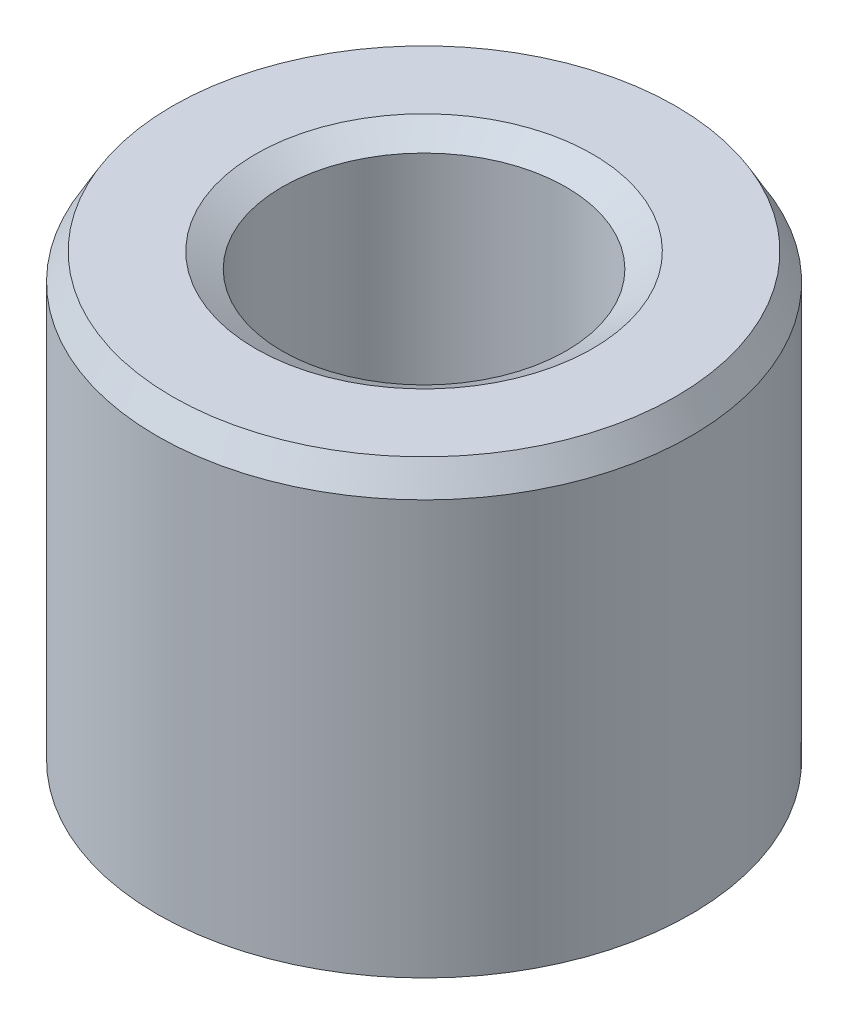
ISO-10303-21;
HEADER;
FILE_DESCRIPTION(('STEP AP214'),'2;1');
FILE_NAME('part.step','',(''),(''),'','','');
FILE_SCHEMA(('AUTOMOTIVE_DESIGN { 1 0 10303 214 1 1 1 1 }'));
ENDSEC;
DATA;
#1=APPLICATION_CONTEXT('core data for automotive mechanical design processes');
#2=APPLICATION_PROTOCOL_DEFINITION('international standard','automotive_design',2000,#1);
#3=PRODUCT_CONTEXT('',#1,'mechanical');
#4=PRODUCT('Part','Part','',(#3));
#5=PRODUCT_RELATED_PRODUCT_CATEGORY('part','',(#4));
#6=PRODUCT_DEFINITION_FORMATION('','',#4);
#7=PRODUCT_DEFINITION_CONTEXT('part definition',#1,'design');
#8=PRODUCT_DEFINITION('design','',#6,#7);
#9=PRODUCT_DEFINITION_SHAPE('','',#8);
#10=(LENGTH_UNIT() NAMED_UNIT(*) SI_UNIT(.MILLI.,.METRE.));
#11=(NAMED_UNIT(*) PLANE_ANGLE_UNIT() SI_UNIT($,.RADIAN.));
#12=(NAMED_UNIT(*) SI_UNIT($,.STERADIAN.) SOLID_ANGLE_UNIT());
#13=UNCERTAINTY_MEASURE_WITH_UNIT(LENGTH_MEASURE(1.E-05),#10,'distance_accuracy_value','');
#14=(GEOMETRIC_REPRESENTATION_CONTEXT(3) GLOBAL_UNCERTAINTY_ASSIGNED_CONTEXT((#13)) GLOBAL_UNIT_ASSIGNED_CONTEXT((#10,
#11,#12)) REPRESENTATION_CONTEXT('',''));
#15=CARTESIAN_POINT('',(0.,0.,0.));
#16=DIRECTION('',(0.,0.,1.));
#17=DIRECTION('',(1.,0.,0.));
#18=AXIS2_PLACEMENT_3D('',#15,#16,#17);
#19=CARTESIAN_POINT('',(0.,8.53663255601621,0.));
#20=DIRECTION('',(0.,-1.,0.));
#21=DIRECTION('',(0.,0.,-1.));
#22=AXIS2_PLACEMENT_3D('',#19,#20,#21);
#23=CYLINDRICAL_SURFACE('',#22,5.);
#24=CARTESIAN_POINT('',(0.,0.286386054229879,0.));
#25=DIRECTION('',(0.,1.,0.));
#26=DIRECTION('',(0.,0.,1.));
#27=AXIS2_PLACEMENT_3D('',#24,#25,#26);
#28=CIRCLE('',#27,5.);
#29=CARTESIAN_POINT('',(0.,0.286386054229879,5.));
#30=VERTEX_POINT('',#29);
#31=EDGE_CURVE('E10',#30,#30,#28,.T.);
#32=ORIENTED_EDGE('',*,*,#31,.T.);
#33=EDGE_LOOP('',(#32));
#34=FACE_BOUND('',#33,.T.);
#35=CARTESIAN_POINT('',(0.,8.04059735951086,0.));
#36=DIRECTION('',(0.,1.,0.));
#37=DIRECTION('',(0.,0.,1.));
#38=AXIS2_PLACEMENT_3D('',#35,#36,#37);
#39=CIRCLE('',#38,5.);
#40=CARTESIAN_POINT('',(0.,8.04059735951086,5.));
#41=VERTEX_POINT('',#40);
#42=EDGE_CURVE('E50',#41,#41,#39,.F.);
#43=ORIENTED_EDGE('',*,*,#42,.T.);
#44=EDGE_LOOP('',(#43));
#45=FACE_BOUND('',#44,.T.);
#46=ADVANCED_FACE('F39',(#34,#45),#23,.T.);
#47=CARTESIAN_POINT('',(0.,8.53663255601621,0.));
#48=DIRECTION('',(0.,1.,0.));
#49=DIRECTION('',(0.,0.,1.));
#50=AXIS2_PLACEMENT_3D('',#47,#48,#49);
#51=PLANE('',#50);
#52=CARTESIAN_POINT('',(0.,8.53663255601621,0.));
#53=DIRECTION('',(0.,1.,0.));
#54=DIRECTION('',(0.,0.,1.));
#55=AXIS2_PLACEMENT_3D('',#52,#53,#54);
#56=CIRCLE('',#55,3.15586327782596);
#57=CARTESIAN_POINT('',(0.,8.53663255601621,3.15586327782596));
#58=VERTEX_POINT('',#57);
#59=EDGE_CURVE('E58',#58,#58,#56,.F.);
#60=ORIENTED_EDGE('',*,*,#59,.T.);
#61=EDGE_LOOP('',(#60));
#62=FACE_BOUND('',#61,.T.);
#63=CARTESIAN_POINT('',(0.,8.53663255601621,0.));
#64=DIRECTION('',(0.,1.,0.));
#65=DIRECTION('',(0.,0.,1.));
#66=AXIS2_PLACEMENT_3D('',#63,#64,#65);
#67=CIRCLE('',#66,4.71361394577012);
#68=CARTESIAN_POINT('',(0.,8.53663255601621,4.71361394577012));
#69=VERTEX_POINT('',#68);
#70=EDGE_CURVE('E61',#69,#69,#67,.T.);
#71=ORIENTED_EDGE('',*,*,#70,.T.);
#72=EDGE_LOOP('',(#71));
#73=FACE_BOUND('',#72,.T.);
#74=ADVANCED_FACE('F88',(#62,#73),#51,.T.);
#75=CARTESIAN_POINT('',(0.,0.,0.));
#76=DIRECTION('',(0.,1.,0.));
#77=DIRECTION('',(0.,0.,1.));
#78=AXIS2_PLACEMENT_3D('',#75,#76,#77);
#79=PLANE('',#78);
#80=CARTESIAN_POINT('',(0.,0.,0.));
#81=DIRECTION('',(0.,1.,0.));
#82=DIRECTION('',(0.,0.,1.));
#83=AXIS2_PLACEMENT_3D('',#80,#81,#82);
#84=CIRCLE('',#83,2.94621413555051);
#85=CARTESIAN_POINT('',(0.,0.,2.94621413555051));
#86=VERTEX_POINT('',#85);
#87=EDGE_CURVE('E51',#86,#86,#84,.T.);
#88=ORIENTED_EDGE('',*,*,#87,.T.);
#89=EDGE_LOOP('',(#88));
#90=FACE_BOUND('',#89,.T.);
#91=CARTESIAN_POINT('',(0.,0.,0.));
#92=DIRECTION('',(0.,1.,0.));
#93=DIRECTION('',(0.,0.,1.));
#94=AXIS2_PLACEMENT_3D('',#91,#92,#93);
#95=CIRCLE('',#94,4.50396480349467);
#96=CARTESIAN_POINT('',(0.,0.,4.50396480349467));
#97=VERTEX_POINT('',#96);
#98=EDGE_CURVE('E54',#97,#97,#95,.F.);
#99=ORIENTED_EDGE('',*,*,#98,.T.);
#100=EDGE_LOOP('',(#99));
#101=FACE_BOUND('',#100,.T.);
#102=ADVANCED_FACE('F83',(#90,#101),#79,.F.);
#103=CARTESIAN_POINT('',(0.,8.53663255601621,0.));
#104=DIRECTION('',(0.,-1.,0.));
#105=DIRECTION('',(0.,0.,-1.));
#106=AXIS2_PLACEMENT_3D('',#103,#104,#105);
#107=CYLINDRICAL_SURFACE('',#106,2.65982808132063);
#108=CARTESIAN_POINT('',(0.,8.25024650178633,0.));
#109=DIRECTION('',(0.,1.,0.));
#110=DIRECTION('',(0.,0.,1.));
#111=AXIS2_PLACEMENT_3D('',#108,#109,#110);
#112=CIRCLE('',#111,2.65982808132063);
#113=CARTESIAN_POINT('',(0.,8.25024650178633,2.65982808132063));
#114=VERTEX_POINT('',#113);
#115=EDGE_CURVE('E67',#114,#114,#112,.T.);
#116=ORIENTED_EDGE('',*,*,#115,.T.);
#117=EDGE_LOOP('',(#116));
#118=FACE_BOUND('',#117,.T.);
#119=CARTESIAN_POINT('',(0.,0.496035196505332,0.));
#120=DIRECTION('',(0.,1.,0.));
#121=DIRECTION('',(0.,0.,1.));
#122=AXIS2_PLACEMENT_3D('',#119,#120,#121);
#123=CIRCLE('',#122,2.65982808132063);
#124=CARTESIAN_POINT('',(0.,0.496035196505332,2.65982808132063));
#125=VERTEX_POINT('',#124);
#126=EDGE_CURVE('E69',#125,#125,#123,.F.);
#127=ORIENTED_EDGE('',*,*,#126,.T.);
#128=EDGE_LOOP('',(#127));
#129=FACE_BOUND('',#128,.T.);
#130=ADVANCED_FACE('F71',(#118,#129),#107,.F.);
#131=CARTESIAN_POINT('',(0.,8.25024650178633,0.));
#132=DIRECTION('',(0.,1.,0.));
#133=DIRECTION('',(0.,0.,1.));
#134=AXIS2_PLACEMENT_3D('',#131,#132,#133);
#135=CONICAL_SURFACE('',#134,2.65982808132063,1.0471975511966);
#136=ORIENTED_EDGE('',*,*,#59,.F.);
#137=EDGE_LOOP('',(#136));
#138=FACE_BOUND('',#137,.T.);
#139=ORIENTED_EDGE('',*,*,#115,.F.);
#140=EDGE_LOOP('',(#139));
#141=FACE_BOUND('',#140,.T.);
#142=ADVANCED_FACE('F77',(#138,#141),#135,.F.);
#143=CARTESIAN_POINT('',(0.,0.,0.));
#144=DIRECTION('',(0.,-1.,0.));
#145=DIRECTION('',(0.,0.,-1.));
#146=AXIS2_PLACEMENT_3D('',#143,#144,#145);
#147=CONICAL_SURFACE('',#146,2.94621413555051,0.523598775598293);
#148=ORIENTED_EDGE('',*,*,#126,.F.);
#149=EDGE_LOOP('',(#148));
#150=FACE_BOUND('',#149,.T.);
#151=ORIENTED_EDGE('',*,*,#87,.F.);
#152=EDGE_LOOP('',(#151));
#153=FACE_BOUND('',#152,.T.);
#154=ADVANCED_FACE('F73',(#150,#153),#147,.F.);
#155=CARTESIAN_POINT('',(0.,0.286386054229879,0.));
#156=DIRECTION('',(0.,1.,0.));
#157=DIRECTION('',(0.,0.,1.));
#158=AXIS2_PLACEMENT_3D('',#155,#156,#157);
#159=CONICAL_SURFACE('',#158,5.,1.0471975511966);
#160=ORIENTED_EDGE('',*,*,#98,.F.);
#161=EDGE_LOOP('',(#160));
#162=FACE_BOUND('',#161,.T.);
#163=ORIENTED_EDGE('',*,*,#31,.F.);
#164=EDGE_LOOP('',(#163));
#165=FACE_BOUND('',#164,.T.);
#166=ADVANCED_FACE('F76',(#162,#165),#159,.T.);
#167=CARTESIAN_POINT('',(0.,8.53663255601621,0.));
#168=DIRECTION('',(0.,-1.,0.));
#169=DIRECTION('',(0.,0.,-1.));
#170=AXIS2_PLACEMENT_3D('',#167,#168,#169);
#171=CONICAL_SURFACE('',#170,4.71361394577012,0.523598775598294);
#172=ORIENTED_EDGE('',*,*,#42,.F.);
#173=EDGE_LOOP('',(#172));
#174=FACE_BOUND('',#173,.T.);
#175=ORIENTED_EDGE('',*,*,#70,.F.);
#176=EDGE_LOOP('',(#175));
#177=FACE_BOUND('',#176,.T.);
#178=ADVANCED_FACE('F45',(#174,#177),#171,.T.);
#179=CLOSED_SHELL('',(#46,#74,#102,#130,#142,#154,#166,#178));
#180=MANIFOLD_SOLID_BREP('B2',#179);
#181=ADVANCED_BREP_SHAPE_REPRESENTATION('',(#18,#180),#14);
#182=SHAPE_DEFINITION_REPRESENTATION(#9,#181);
ENDSEC;
END-ISO-10303-21;
